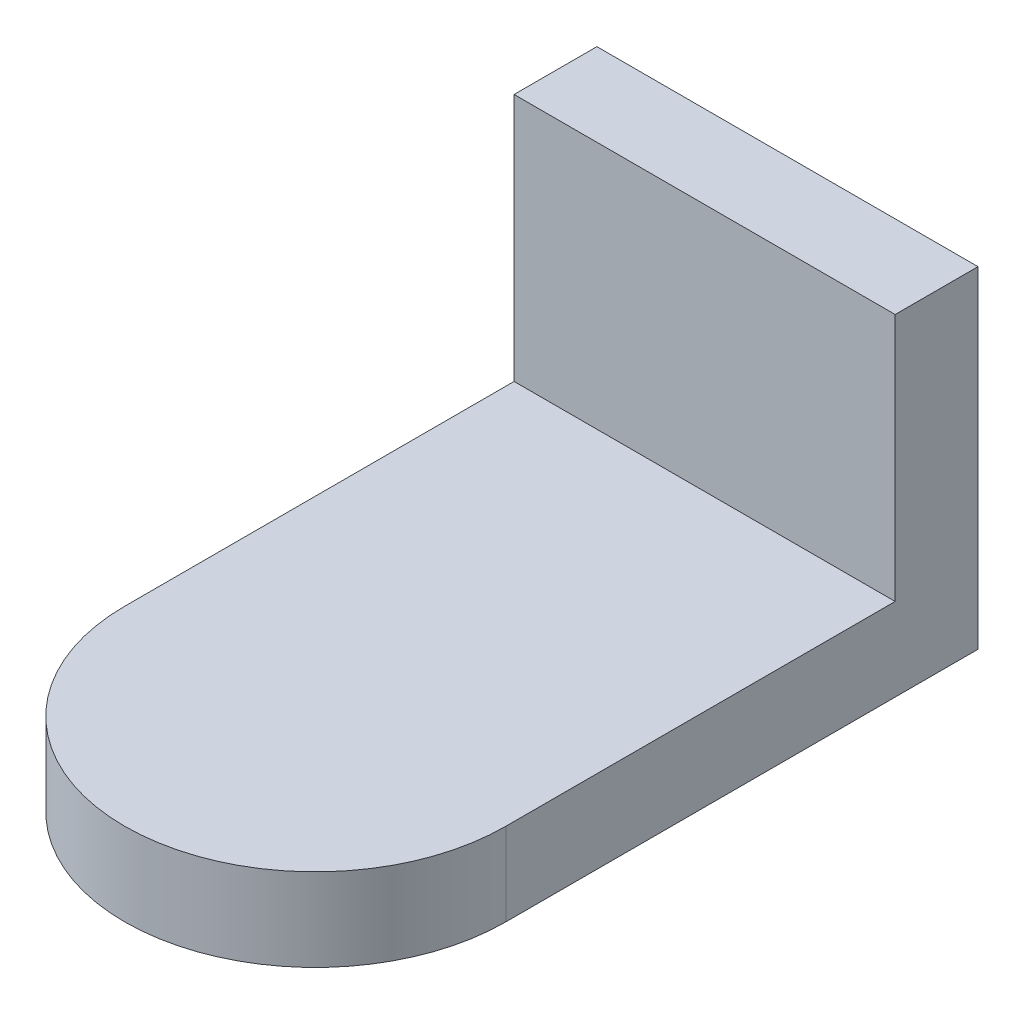
ISO-10303-21;
HEADER;
FILE_DESCRIPTION(('STEP AP214'),'2;1');
FILE_NAME('part.step','',(''),(''),'','','');
FILE_SCHEMA(('AUTOMOTIVE_DESIGN { 1 0 10303 214 1 1 1 1 }'));
ENDSEC;
DATA;
#1=APPLICATION_CONTEXT('core data for automotive mechanical design processes');
#2=APPLICATION_PROTOCOL_DEFINITION('international standard','automotive_design',2000,#1);
#3=PRODUCT_CONTEXT('',#1,'mechanical');
#4=PRODUCT('Part','Part','',(#3));
#5=PRODUCT_RELATED_PRODUCT_CATEGORY('part','',(#4));
#6=PRODUCT_DEFINITION_FORMATION('','',#4);
#7=PRODUCT_DEFINITION_CONTEXT('part definition',#1,'design');
#8=PRODUCT_DEFINITION('design','',#6,#7);
#9=PRODUCT_DEFINITION_SHAPE('','',#8);
#10=(LENGTH_UNIT() NAMED_UNIT(*) SI_UNIT(.MILLI.,.METRE.));
#11=(NAMED_UNIT(*) PLANE_ANGLE_UNIT() SI_UNIT($,.RADIAN.));
#12=(NAMED_UNIT(*) SI_UNIT($,.STERADIAN.) SOLID_ANGLE_UNIT());
#13=UNCERTAINTY_MEASURE_WITH_UNIT(LENGTH_MEASURE(1.E-05),#10,'distance_accuracy_value','');
#14=(GEOMETRIC_REPRESENTATION_CONTEXT(3) GLOBAL_UNCERTAINTY_ASSIGNED_CONTEXT((#13)) GLOBAL_UNIT_ASSIGNED_CONTEXT((#10,
#11,#12)) REPRESENTATION_CONTEXT('',''));
#15=CARTESIAN_POINT('',(0.,0.,0.));
#16=DIRECTION('',(0.,0.,1.));
#17=DIRECTION('',(1.,0.,0.));
#18=AXIS2_PLACEMENT_3D('',#15,#16,#17);
#19=CARTESIAN_POINT('',(0.,0.,-1.45));
#20=DIRECTION('',(0.,0.,1.));
#21=DIRECTION('',(-1.,0.,0.));
#22=AXIS2_PLACEMENT_3D('',#19,#20,#21);
#23=PLANE('',#22);
#24=DIRECTION('',(0.,1.,0.));
#25=VECTOR('',#24,1.);
#26=CARTESIAN_POINT('',(0.365,-0.2,-1.45));
#27=LINE('',#26,#25);
#28=CARTESIAN_POINT('',(0.365,-0.35,-1.45));
#29=VERTEX_POINT('',#28);
#30=CARTESIAN_POINT('',(0.365,-0.2,-1.45));
#31=VERTEX_POINT('',#30);
#32=EDGE_CURVE('E11',#29,#31,#27,.T.);
#33=ORIENTED_EDGE('',*,*,#32,.T.);
#34=DIRECTION('',(-1.,0.,0.));
#35=VECTOR('',#34,1.);
#36=CARTESIAN_POINT('',(0.135,-0.2,-1.45));
#37=LINE('',#36,#35);
#38=CARTESIAN_POINT('',(0.135,-0.2,-1.45));
#39=VERTEX_POINT('',#38);
#40=EDGE_CURVE('E24',#31,#39,#37,.T.);
#41=ORIENTED_EDGE('',*,*,#40,.T.);
#42=DIRECTION('',(0.,-1.,0.));
#43=VECTOR('',#42,1.);
#44=CARTESIAN_POINT('',(0.135,-0.2,-1.45));
#45=LINE('',#44,#43);
#46=CARTESIAN_POINT('',(0.135,-0.35,-1.45));
#47=VERTEX_POINT('',#46);
#48=EDGE_CURVE('E117',#39,#47,#45,.T.);
#49=ORIENTED_EDGE('',*,*,#48,.T.);
#50=DIRECTION('',(-1.,0.,0.));
#51=VECTOR('',#50,1.);
#52=CARTESIAN_POINT('',(0.135,-0.35,-1.45));
#53=LINE('',#52,#51);
#54=EDGE_CURVE('E85',#29,#47,#53,.T.);
#55=ORIENTED_EDGE('',*,*,#54,.F.);
#56=EDGE_LOOP('',(#33,#41,#49,#55));
#57=FACE_BOUND('',#56,.T.);
#58=ADVANCED_FACE('F17',(#57),#23,.T.);
#59=CARTESIAN_POINT('',(0.135,-0.2,-1.45));
#60=DIRECTION('',(0.,1.,0.));
#61=DIRECTION('',(-1.,0.,0.));
#62=AXIS2_PLACEMENT_3D('',#59,#60,#61);
#63=PLANE('',#62);
#64=DIRECTION('',(-1.,0.,0.));
#65=VECTOR('',#64,1.);
#66=CARTESIAN_POINT('',(0.135,-0.2,-1.5));
#67=LINE('',#66,#65);
#68=CARTESIAN_POINT('',(0.365,-0.2,-1.5));
#69=VERTEX_POINT('',#68);
#70=CARTESIAN_POINT('',(0.135,-0.2,-1.5));
#71=VERTEX_POINT('',#70);
#72=EDGE_CURVE('E114',#69,#71,#67,.T.);
#73=ORIENTED_EDGE('',*,*,#72,.T.);
#74=DIRECTION('',(0.,0.,-1.));
#75=VECTOR('',#74,1.);
#76=CARTESIAN_POINT('',(0.135,-0.2,-1.45));
#77=LINE('',#76,#75);
#78=EDGE_CURVE('E111',#39,#71,#77,.T.);
#79=ORIENTED_EDGE('',*,*,#78,.F.);
#80=ORIENTED_EDGE('',*,*,#40,.F.);
#81=DIRECTION('',(0.,0.,-1.));
#82=VECTOR('',#81,1.);
#83=CARTESIAN_POINT('',(0.365,-0.2,-1.45));
#84=LINE('',#83,#82);
#85=EDGE_CURVE('E108',#31,#69,#84,.T.);
#86=ORIENTED_EDGE('',*,*,#85,.T.);
#87=EDGE_LOOP('',(#73,#79,#80,#86));
#88=FACE_BOUND('',#87,.T.);
#89=ADVANCED_FACE('F121',(#88),#63,.T.);
#90=CARTESIAN_POINT('',(0.365,-0.2,-1.45));
#91=DIRECTION('',(1.,0.,0.));
#92=DIRECTION('',(0.,0.,1.));
#93=AXIS2_PLACEMENT_3D('',#90,#91,#92);
#94=PLANE('',#93);
#95=DIRECTION('',(0.,1.,0.));
#96=VECTOR('',#95,1.);
#97=CARTESIAN_POINT('',(0.365,-0.2,-1.5));
#98=LINE('',#97,#96);
#99=CARTESIAN_POINT('',(0.365,-0.4,-1.5));
#100=VERTEX_POINT('',#99);
#101=EDGE_CURVE('E105',#100,#69,#98,.T.);
#102=ORIENTED_EDGE('',*,*,#101,.T.);
#103=ORIENTED_EDGE('',*,*,#85,.F.);
#104=ORIENTED_EDGE('',*,*,#32,.F.);
#105=DIRECTION('',(0.,0.,-1.));
#106=VECTOR('',#105,1.);
#107=CARTESIAN_POINT('',(0.365,-0.35,-1.45));
#108=LINE('',#107,#106);
#109=CARTESIAN_POINT('',(0.365,-0.35,-1.215));
#110=VERTEX_POINT('',#109);
#111=EDGE_CURVE('E103',#110,#29,#108,.T.);
#112=ORIENTED_EDGE('',*,*,#111,.F.);
#113=DIRECTION('',(0.,-1.,0.));
#114=VECTOR('',#113,1.);
#115=CARTESIAN_POINT('',(0.365,-0.35,-1.215));
#116=LINE('',#115,#114);
#117=CARTESIAN_POINT('',(0.365,-0.4,-1.215));
#118=VERTEX_POINT('',#117);
#119=EDGE_CURVE('E89',#110,#118,#116,.T.);
#120=ORIENTED_EDGE('',*,*,#119,.T.);
#121=DIRECTION('',(0.,0.,-1.));
#122=VECTOR('',#121,1.);
#123=CARTESIAN_POINT('',(0.365,-0.4,-1.45));
#124=LINE('',#123,#122);
#125=EDGE_CURVE('E99',#118,#100,#124,.T.);
#126=ORIENTED_EDGE('',*,*,#125,.T.);
#127=EDGE_LOOP('',(#102,#103,#104,#112,#120,#126));
#128=FACE_BOUND('',#127,.T.);
#129=ADVANCED_FACE('F127',(#128),#94,.T.);
#130=CARTESIAN_POINT('',(0.135,-0.4,-1.45));
#131=DIRECTION('',(0.,-1.,0.));
#132=DIRECTION('',(1.,0.,0.));
#133=AXIS2_PLACEMENT_3D('',#130,#131,#132);
#134=PLANE('',#133);
#135=DIRECTION('',(1.,0.,0.));
#136=VECTOR('',#135,1.);
#137=CARTESIAN_POINT('',(0.135,-0.4,-1.5));
#138=LINE('',#137,#136);
#139=CARTESIAN_POINT('',(0.135,-0.4,-1.5));
#140=VERTEX_POINT('',#139);
#141=EDGE_CURVE('E96',#140,#100,#138,.T.);
#142=ORIENTED_EDGE('',*,*,#141,.T.);
#143=ORIENTED_EDGE('',*,*,#125,.F.);
#144=CARTESIAN_POINT('',(0.25,-0.4,-1.215));
#145=DIRECTION('',(0.,1.,0.));
#146=DIRECTION('',(1.,0.,0.));
#147=AXIS2_PLACEMENT_3D('',#144,#145,#146);
#148=CIRCLE('',#147,0.115);
#149=CARTESIAN_POINT('',(0.135,-0.4,-1.215));
#150=VERTEX_POINT('',#149);
#151=EDGE_CURVE('E94',#150,#118,#148,.T.);
#152=ORIENTED_EDGE('',*,*,#151,.F.);
#153=DIRECTION('',(0.,0.,-1.));
#154=VECTOR('',#153,1.);
#155=CARTESIAN_POINT('',(0.135,-0.4,-1.45));
#156=LINE('',#155,#154);
#157=EDGE_CURVE('E73',#150,#140,#156,.T.);
#158=ORIENTED_EDGE('',*,*,#157,.T.);
#159=EDGE_LOOP('',(#142,#143,#152,#158));
#160=FACE_BOUND('',#159,.T.);
#161=ADVANCED_FACE('F126',(#160),#134,.T.);
#162=CARTESIAN_POINT('',(0.135,-0.2,-1.45));
#163=DIRECTION('',(-1.,0.,0.));
#164=DIRECTION('',(0.,0.,-1.));
#165=AXIS2_PLACEMENT_3D('',#162,#163,#164);
#166=PLANE('',#165);
#167=DIRECTION('',(0.,-1.,0.));
#168=VECTOR('',#167,1.);
#169=CARTESIAN_POINT('',(0.135,-0.2,-1.5));
#170=LINE('',#169,#168);
#171=EDGE_CURVE('E77',#71,#140,#170,.T.);
#172=ORIENTED_EDGE('',*,*,#171,.T.);
#173=ORIENTED_EDGE('',*,*,#157,.F.);
#174=DIRECTION('',(0.,-1.,0.));
#175=VECTOR('',#174,1.);
#176=CARTESIAN_POINT('',(0.135,-0.35,-1.215));
#177=LINE('',#176,#175);
#178=CARTESIAN_POINT('',(0.135,-0.35,-1.215));
#179=VERTEX_POINT('',#178);
#180=EDGE_CURVE('E66',#179,#150,#177,.T.);
#181=ORIENTED_EDGE('',*,*,#180,.F.);
#182=DIRECTION('',(0.,0.,1.));
#183=VECTOR('',#182,1.);
#184=CARTESIAN_POINT('',(0.135,-0.35,-1.45));
#185=LINE('',#184,#183);
#186=EDGE_CURVE('E71',#47,#179,#185,.T.);
#187=ORIENTED_EDGE('',*,*,#186,.F.);
#188=ORIENTED_EDGE('',*,*,#48,.F.);
#189=ORIENTED_EDGE('',*,*,#78,.T.);
#190=EDGE_LOOP('',(#172,#173,#181,#187,#188,#189));
#191=FACE_BOUND('',#190,.T.);
#192=ADVANCED_FACE('F69',(#191),#166,.T.);
#193=CARTESIAN_POINT('',(0.,0.,-1.5));
#194=DIRECTION('',(0.,0.,1.));
#195=DIRECTION('',(-1.,0.,0.));
#196=AXIS2_PLACEMENT_3D('',#193,#194,#195);
#197=PLANE('',#196);
#198=ORIENTED_EDGE('',*,*,#72,.F.);
#199=ORIENTED_EDGE('',*,*,#101,.F.);
#200=ORIENTED_EDGE('',*,*,#141,.F.);
#201=ORIENTED_EDGE('',*,*,#171,.F.);
#202=EDGE_LOOP('',(#198,#199,#200,#201));
#203=FACE_BOUND('',#202,.T.);
#204=ADVANCED_FACE('F123',(#203),#197,.F.);
#205=CARTESIAN_POINT('',(0.25,-0.35,-1.215));
#206=DIRECTION('',(0.,-1.,0.));
#207=DIRECTION('',(1.,0.,0.));
#208=AXIS2_PLACEMENT_3D('',#205,#206,#207);
#209=CYLINDRICAL_SURFACE('',#208,0.115);
#210=ORIENTED_EDGE('',*,*,#151,.T.);
#211=ORIENTED_EDGE('',*,*,#119,.F.);
#212=CARTESIAN_POINT('',(0.25,-0.35,-1.215));
#213=DIRECTION('',(0.,1.,0.));
#214=DIRECTION('',(1.,0.,0.));
#215=AXIS2_PLACEMENT_3D('',#212,#213,#214);
#216=CIRCLE('',#215,0.115);
#217=EDGE_CURVE('E84',#179,#110,#216,.T.);
#218=ORIENTED_EDGE('',*,*,#217,.F.);
#219=ORIENTED_EDGE('',*,*,#180,.T.);
#220=EDGE_LOOP('',(#210,#211,#218,#219));
#221=FACE_BOUND('',#220,.T.);
#222=ADVANCED_FACE('F88',(#221),#209,.T.);
#223=CARTESIAN_POINT('',(0.25,-0.35,-1.215));
#224=DIRECTION('',(0.,-1.,0.));
#225=DIRECTION('',(1.,0.,0.));
#226=AXIS2_PLACEMENT_3D('',#223,#224,#225);
#227=PLANE('',#226);
#228=ORIENTED_EDGE('',*,*,#186,.T.);
#229=ORIENTED_EDGE('',*,*,#217,.T.);
#230=ORIENTED_EDGE('',*,*,#111,.T.);
#231=ORIENTED_EDGE('',*,*,#54,.T.);
#232=EDGE_LOOP('',(#228,#229,#230,#231));
#233=FACE_BOUND('',#232,.T.);
#234=ADVANCED_FACE('F82',(#233),#227,.F.);
#235=CLOSED_SHELL('',(#58,#89,#129,#161,#192,#204,#222,#234));
#236=MANIFOLD_SOLID_BREP('B1',#235);
#237=ADVANCED_BREP_SHAPE_REPRESENTATION('',(#18,#236),#14);
#238=SHAPE_DEFINITION_REPRESENTATION(#9,#237);
ENDSEC;
END-ISO-10303-21;
